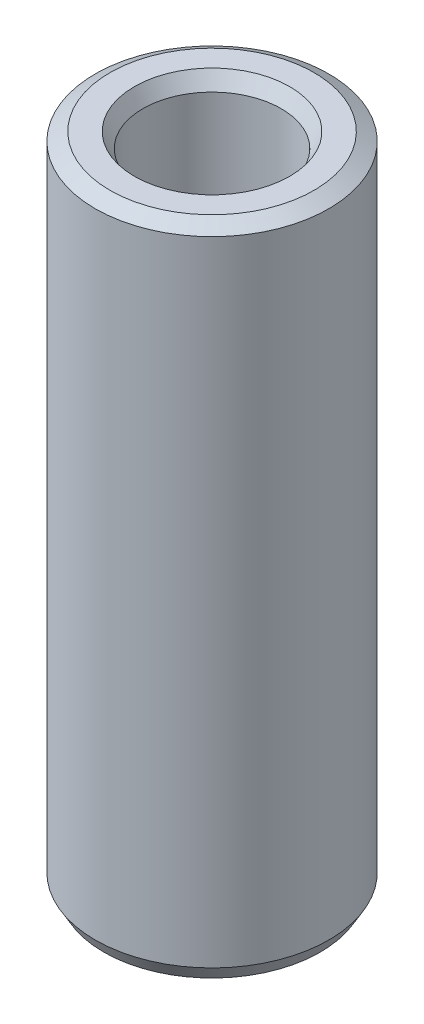
ISO-10303-21;
HEADER;
FILE_DESCRIPTION(('STEP AP214'),'2;1');
FILE_NAME('part.step','',(''),(''),'','','');
FILE_SCHEMA(('AUTOMOTIVE_DESIGN { 1 0 10303 214 1 1 1 1 }'));
ENDSEC;
DATA;
#1=APPLICATION_CONTEXT('core data for automotive mechanical design processes');
#2=APPLICATION_PROTOCOL_DEFINITION('international standard','automotive_design',2000,#1);
#3=PRODUCT_CONTEXT('',#1,'mechanical');
#4=PRODUCT('Part','Part','',(#3));
#5=PRODUCT_RELATED_PRODUCT_CATEGORY('part','',(#4));
#6=PRODUCT_DEFINITION_FORMATION('','',#4);
#7=PRODUCT_DEFINITION_CONTEXT('part definition',#1,'design');
#8=PRODUCT_DEFINITION('design','',#6,#7);
#9=PRODUCT_DEFINITION_SHAPE('','',#8);
#10=(LENGTH_UNIT() NAMED_UNIT(*) SI_UNIT(.MILLI.,.METRE.));
#11=(NAMED_UNIT(*) PLANE_ANGLE_UNIT() SI_UNIT($,.RADIAN.));
#12=(NAMED_UNIT(*) SI_UNIT($,.STERADIAN.) SOLID_ANGLE_UNIT());
#13=UNCERTAINTY_MEASURE_WITH_UNIT(LENGTH_MEASURE(1.E-05),#10,'distance_accuracy_value','');
#14=(GEOMETRIC_REPRESENTATION_CONTEXT(3) GLOBAL_UNCERTAINTY_ASSIGNED_CONTEXT((#13)) GLOBAL_UNIT_ASSIGNED_CONTEXT((#10,
#11,#12)) REPRESENTATION_CONTEXT('',''));
#15=CARTESIAN_POINT('',(0.,0.,0.));
#16=DIRECTION('',(0.,0.,1.));
#17=DIRECTION('',(1.,0.,0.));
#18=AXIS2_PLACEMENT_3D('',#15,#16,#17);
#19=CARTESIAN_POINT('',(0.,210.799337200619,0.));
#20=DIRECTION('',(0.,-1.,0.));
#21=DIRECTION('',(0.,0.,-1.));
#22=AXIS2_PLACEMENT_3D('',#19,#20,#21);
#23=CYLINDRICAL_SURFACE('',#22,37.5);
#24=CARTESIAN_POINT('',(0.,4.74482069295848,0.));
#25=DIRECTION('',(0.,1.,0.));
#26=DIRECTION('',(0.,0.,1.));
#27=AXIS2_PLACEMENT_3D('',#24,#25,#26);
#28=CIRCLE('',#27,37.5);
#29=CARTESIAN_POINT('',(0.,4.74482069295848,37.5));
#30=VERTEX_POINT('',#29);
#31=EDGE_CURVE('E10',#30,#30,#28,.T.);
#32=ORIENTED_EDGE('',*,*,#31,.T.);
#33=EDGE_LOOP('',(#32));
#34=FACE_BOUND('',#33,.T.);
#35=CARTESIAN_POINT('',(0.,208.059913696283,0.));
#36=DIRECTION('',(0.,1.,0.));
#37=DIRECTION('',(0.,0.,1.));
#38=AXIS2_PLACEMENT_3D('',#35,#36,#37);
#39=CIRCLE('',#38,37.5);
#40=CARTESIAN_POINT('',(0.,208.059913696283,37.5));
#41=VERTEX_POINT('',#40);
#42=EDGE_CURVE('E50',#41,#41,#39,.F.);
#43=ORIENTED_EDGE('',*,*,#42,.T.);
#44=EDGE_LOOP('',(#43));
#45=FACE_BOUND('',#44,.T.);
#46=ADVANCED_FACE('F39',(#34,#45),#23,.T.);
#47=CARTESIAN_POINT('',(0.,210.799337200619,0.));
#48=DIRECTION('',(0.,1.,0.));
#49=DIRECTION('',(0.,0.,1.));
#50=AXIS2_PLACEMENT_3D('',#47,#48,#49);
#51=PLANE('',#50);
#52=CARTESIAN_POINT('',(0.,210.799337200619,0.));
#53=DIRECTION('',(0.,1.,0.));
#54=DIRECTION('',(0.,0.,1.));
#55=AXIS2_PLACEMENT_3D('',#52,#53,#54);
#56=CIRCLE('',#55,24.9423415267909);
#57=CARTESIAN_POINT('',(0.,210.799337200619,24.9423415267909));
#58=VERTEX_POINT('',#57);
#59=EDGE_CURVE('E58',#58,#58,#56,.F.);
#60=ORIENTED_EDGE('',*,*,#59,.T.);
#61=EDGE_LOOP('',(#60));
#62=FACE_BOUND('',#61,.T.);
#63=CARTESIAN_POINT('',(0.,210.799337200619,0.));
#64=DIRECTION('',(0.,1.,0.));
#65=DIRECTION('',(0.,0.,1.));
#66=AXIS2_PLACEMENT_3D('',#63,#64,#65);
#67=CIRCLE('',#66,32.7551793070414);
#68=CARTESIAN_POINT('',(0.,210.799337200619,32.7551793070414));
#69=VERTEX_POINT('',#68);
#70=EDGE_CURVE('E61',#69,#69,#67,.T.);
#71=ORIENTED_EDGE('',*,*,#70,.T.);
#72=EDGE_LOOP('',(#71));
#73=FACE_BOUND('',#72,.T.);
#74=ADVANCED_FACE('F88',(#62,#73),#51,.T.);
#75=CARTESIAN_POINT('',(0.,0.,0.));
#76=DIRECTION('',(0.,1.,0.));
#77=DIRECTION('',(0.,0.,1.));
#78=AXIS2_PLACEMENT_3D('',#75,#76,#77);
#79=PLANE('',#78);
#80=CARTESIAN_POINT('',(0.,0.,0.));
#81=DIRECTION('',(0.,1.,0.));
#82=DIRECTION('',(0.,0.,1.));
#83=AXIS2_PLACEMENT_3D('',#80,#81,#82);
#84=CIRCLE('',#83,26.9477387154134);
#85=CARTESIAN_POINT('',(0.,0.,26.9477387154134));
#86=VERTEX_POINT('',#85);
#87=EDGE_CURVE('E51',#86,#86,#84,.T.);
#88=ORIENTED_EDGE('',*,*,#87,.T.);
#89=EDGE_LOOP('',(#88));
#90=FACE_BOUND('',#89,.T.);
#91=CARTESIAN_POINT('',(0.,0.,0.));
#92=DIRECTION('',(0.,1.,0.));
#93=DIRECTION('',(0.,0.,1.));
#94=AXIS2_PLACEMENT_3D('',#91,#92,#93);
#95=CIRCLE('',#94,34.7605764956639);
#96=CARTESIAN_POINT('',(0.,0.,34.7605764956639));
#97=VERTEX_POINT('',#96);
#98=EDGE_CURVE('E54',#97,#97,#95,.F.);
#99=ORIENTED_EDGE('',*,*,#98,.T.);
#100=EDGE_LOOP('',(#99));
#101=FACE_BOUND('',#100,.T.);
#102=ADVANCED_FACE('F83',(#90,#101),#79,.F.);
#103=CARTESIAN_POINT('',(0.,210.799337200619,0.));
#104=DIRECTION('',(0.,-1.,0.));
#105=DIRECTION('',(0.,0.,-1.));
#106=AXIS2_PLACEMENT_3D('',#103,#104,#105);
#107=CYLINDRICAL_SURFACE('',#106,22.2029180224547);
#108=CARTESIAN_POINT('',(0.,206.05451650766,0.));
#109=DIRECTION('',(0.,1.,0.));
#110=DIRECTION('',(0.,0.,1.));
#111=AXIS2_PLACEMENT_3D('',#108,#109,#110);
#112=CIRCLE('',#111,22.2029180224547);
#113=CARTESIAN_POINT('',(0.,206.05451650766,22.2029180224547));
#114=VERTEX_POINT('',#113);
#115=EDGE_CURVE('E67',#114,#114,#112,.T.);
#116=ORIENTED_EDGE('',*,*,#115,.T.);
#117=EDGE_LOOP('',(#116));
#118=FACE_BOUND('',#117,.T.);
#119=CARTESIAN_POINT('',(0.,2.7394235043362,0.));
#120=DIRECTION('',(0.,1.,0.));
#121=DIRECTION('',(0.,0.,1.));
#122=AXIS2_PLACEMENT_3D('',#119,#120,#121);
#123=CIRCLE('',#122,22.2029180224547);
#124=CARTESIAN_POINT('',(0.,2.7394235043362,22.2029180224547));
#125=VERTEX_POINT('',#124);
#126=EDGE_CURVE('E69',#125,#125,#123,.F.);
#127=ORIENTED_EDGE('',*,*,#126,.T.);
#128=EDGE_LOOP('',(#127));
#129=FACE_BOUND('',#128,.T.);
#130=ADVANCED_FACE('F71',(#118,#129),#107,.F.);
#131=CARTESIAN_POINT('',(0.,206.05451650766,0.));
#132=DIRECTION('',(0.,1.,0.));
#133=DIRECTION('',(0.,0.,1.));
#134=AXIS2_PLACEMENT_3D('',#131,#132,#133);
#135=CONICAL_SURFACE('',#134,22.2029180224547,0.523598775598297);
#136=ORIENTED_EDGE('',*,*,#59,.F.);
#137=EDGE_LOOP('',(#136));
#138=FACE_BOUND('',#137,.T.);
#139=ORIENTED_EDGE('',*,*,#115,.F.);
#140=EDGE_LOOP('',(#139));
#141=FACE_BOUND('',#140,.T.);
#142=ADVANCED_FACE('F77',(#138,#141),#135,.F.);
#143=CARTESIAN_POINT('',(0.,0.,0.));
#144=DIRECTION('',(0.,-1.,0.));
#145=DIRECTION('',(0.,0.,-1.));
#146=AXIS2_PLACEMENT_3D('',#143,#144,#145);
#147=CONICAL_SURFACE('',#146,26.9477387154134,1.04719755119659);
#148=ORIENTED_EDGE('',*,*,#126,.F.);
#149=EDGE_LOOP('',(#148));
#150=FACE_BOUND('',#149,.T.);
#151=ORIENTED_EDGE('',*,*,#87,.F.);
#152=EDGE_LOOP('',(#151));
#153=FACE_BOUND('',#152,.T.);
#154=ADVANCED_FACE('F73',(#150,#153),#147,.F.);
#155=CARTESIAN_POINT('',(0.,4.74482069295848,0.));
#156=DIRECTION('',(0.,1.,0.));
#157=DIRECTION('',(0.,0.,1.));
#158=AXIS2_PLACEMENT_3D('',#155,#156,#157);
#159=CONICAL_SURFACE('',#158,37.5,0.523598775598302);
#160=CARTESIAN_POINT('',(0.,0.,34.7605764956639));
#161=CARTESIAN_POINT('',(0.,0.0494252155516499,34.7891121571674));
#162=CARTESIAN_POINT('',(0.,0.0988504311033008,34.8176478186709));
#163=CARTESIAN_POINT('',(0.,0.197700862206602,34.8747191416779));
#164=CARTESIAN_POINT('',(0.,0.247126077758253,34.9032548031814));
#165=CARTESIAN_POINT('',(0.,0.345976508861555,34.9603261261884));
#166=CARTESIAN_POINT('',(0.,0.395401724413206,34.9888617876919));
#167=CARTESIAN_POINT('',(0.,0.494252155516507,35.0459331106989));
#168=CARTESIAN_POINT('',(0.,0.543677371068158,35.0744687722024));
#169=CARTESIAN_POINT('',(0.,0.64252780217146,35.1315400952094));
#170=CARTESIAN_POINT('',(0.,0.691953017723111,35.1600757567129));
#171=CARTESIAN_POINT('',(0.,0.790803448826412,35.2171470797199));
#172=CARTESIAN_POINT('',(0.,0.840228664378063,35.2456827412234));
#173=CARTESIAN_POINT('',(0.,0.939079095481364,35.3027540642304));
#174=CARTESIAN_POINT('',(0.,0.988504311033015,35.3312897257339));
#175=CARTESIAN_POINT('',(0.,1.08735474213632,35.3883610487409));
#176=CARTESIAN_POINT('',(0.,1.13677995768797,35.4168967102444));
#177=CARTESIAN_POINT('',(0.,1.23563038879127,35.4739680332514));
#178=CARTESIAN_POINT('',(0.,1.28505560434292,35.5025036947549));
#179=CARTESIAN_POINT('',(0.,1.38390603544622,35.5595750177619));
#180=CARTESIAN_POINT('',(0.,1.43333125099787,35.5881106792654));
#181=CARTESIAN_POINT('',(0.,1.53218168210117,35.6451820022724));
#182=CARTESIAN_POINT('',(0.,1.58160689765282,35.6737176637759));
#183=CARTESIAN_POINT('',(0.,1.68045732875613,35.7307889867829));
#184=CARTESIAN_POINT('',(0.,1.72988254430778,35.7593246482864));
#185=CARTESIAN_POINT('',(0.,1.82873297541108,35.8163959712934));
#186=CARTESIAN_POINT('',(0.,1.87815819096273,35.8449316327969));
#187=CARTESIAN_POINT('',(0.,1.97700862206603,35.9020029558039));
#188=CARTESIAN_POINT('',(0.,2.02643383761768,35.9305386173074));
#189=CARTESIAN_POINT('',(0.,2.12528426872098,35.9876099403144));
#190=CARTESIAN_POINT('',(0.,2.17470948427264,36.0161456018179));
#191=CARTESIAN_POINT('',(0.,2.27355991537594,36.0732169248249));
#192=CARTESIAN_POINT('',(0.,2.32298513092759,36.1017525863285));
#193=CARTESIAN_POINT('',(0.,2.42183556203089,36.1588239093355));
#194=CARTESIAN_POINT('',(0.,2.47126077758254,36.187359570839));
#195=CARTESIAN_POINT('',(0.,2.57011120868584,36.244430893846));
#196=CARTESIAN_POINT('',(0.,2.61953642423749,36.2729665553495));
#197=CARTESIAN_POINT('',(0.,2.71838685534079,36.3300378783565));
#198=CARTESIAN_POINT('',(0.,2.76781207089245,36.35857353986));
#199=CARTESIAN_POINT('',(0.,2.86666250199575,36.415644862867));
#200=CARTESIAN_POINT('',(0.,2.9160877175474,36.4441805243705));
#201=CARTESIAN_POINT('',(0.,3.0149381486507,36.5012518473775));
#202=CARTESIAN_POINT('',(0.,3.06436336420235,36.529787508881));
#203=CARTESIAN_POINT('',(0.,3.16321379530565,36.586858831888));
#204=CARTESIAN_POINT('',(0.,3.2126390108573,36.6153944933915));
#205=CARTESIAN_POINT('',(0.,3.3114894419606,36.6724658163985));
#206=CARTESIAN_POINT('',(0.,3.36091465751226,36.701001477902));
#207=CARTESIAN_POINT('',(0.,3.45976508861556,36.758072800909));
#208=CARTESIAN_POINT('',(0.,3.50919030416721,36.7866084624125));
#209=CARTESIAN_POINT('',(0.,3.60804073527051,36.8436797854195));
#210=CARTESIAN_POINT('',(0.,3.65746595082216,36.872215446923));
#211=CARTESIAN_POINT('',(0.,3.75631638192546,36.92928676993));
#212=CARTESIAN_POINT('',(0.,3.80574159747711,36.9578224314335));
#213=CARTESIAN_POINT('',(0.,3.90459202858041,37.0148937544405));
#214=CARTESIAN_POINT('',(0.,3.95401724413207,37.043429415944));
#215=CARTESIAN_POINT('',(0.,4.05286767523537,37.100500738951));
#216=CARTESIAN_POINT('',(0.,4.10229289078702,37.1290364004545));
#217=CARTESIAN_POINT('',(0.,4.20114332189032,37.1861077234615));
#218=CARTESIAN_POINT('',(0.,4.25056853744197,37.214643384965));
#219=CARTESIAN_POINT('',(0.,4.34941896854527,37.271714707972));
#220=CARTESIAN_POINT('',(0.,4.39884418409692,37.3002503694755));
#221=CARTESIAN_POINT('',(0.,4.49769461520022,37.3573216924825));
#222=CARTESIAN_POINT('',(0.,4.54711983075187,37.385857353986));
#223=CARTESIAN_POINT('',(0.,4.64597026185518,37.442928676993));
#224=CARTESIAN_POINT('',(0.,4.69539547740683,37.4714643384965));
#225=CARTESIAN_POINT('',(0.,4.74482069295848,37.5));
#226=B_SPLINE_CURVE_WITH_KNOTS('',3,(#160,#161,#162,#163,#164,#165,#166,#167,#168,#169,#170,
#171,#172,#173,#174,#175,#176,#177,#178,#179,#180,#181,#182,#183,#184,#185,#186,#187,#188,#189,
#190,#191,#192,#193,#194,#195,#196,#197,#198,#199,#200,#201,#202,#203,#204,#205,#206,#207,#208,
#209,#210,#211,#212,#213,#214,#215,#216,#217,#218,#219,#220,#221,#222,#223,#224,#225),
.UNSPECIFIED.,.F.,.F.,(4,2,2,2,2,2,2,2,2,2,2,2,2,2,2,2,2,2,2,2,2,2,2,2,2,2,2,2,2,2,2,2,4),(0.,
0.171213969021005,0.342427938042011,0.513641907063016,0.684855876084022,0.856069845105027,
1.02728381412603,1.19849778314704,1.36971175216804,1.54092572118905,1.71213969021005,
1.88335365923106,2.05456762825207,2.22578159727307,2.39699556629408,2.56820953531508,
2.73942350433609,2.91063747335709,3.0818514423781,3.2530654113991,3.42427938042011,
3.59549334944112,3.76670731846212,3.93792128748313,4.10913525650413,4.28034922552514,
4.45156319454615,4.62277716356715,4.79399113258816,4.96520510160916,5.13641907063017,
5.30763303965118,5.47884700867218),.UNSPECIFIED.);
#227=EDGE_CURVE('BSEAM76',#97,#30,#226,.T.);
#228=ORIENTED_EDGE('',*,*,#98,.F.);
#229=ORIENTED_EDGE('',*,*,#31,.F.);
#230=ORIENTED_EDGE('',*,*,#227,.T.);
#231=ORIENTED_EDGE('',*,*,#227,.F.);
#232=EDGE_LOOP('',(#228,#230,#229,#231));
#233=FACE_BOUND('',#232,.T.);
#234=ADVANCED_FACE('F76',(#233),#159,.T.);
#235=CARTESIAN_POINT('',(0.,210.799337200619,0.));
#236=DIRECTION('',(0.,-1.,0.));
#237=DIRECTION('',(0.,0.,-1.));
#238=AXIS2_PLACEMENT_3D('',#235,#236,#237);
#239=CONICAL_SURFACE('',#238,32.7551793070414,1.04719755119659);
#240=ORIENTED_EDGE('',*,*,#42,.F.);
#241=EDGE_LOOP('',(#240));
#242=FACE_BOUND('',#241,.T.);
#243=ORIENTED_EDGE('',*,*,#70,.F.);
#244=EDGE_LOOP('',(#243));
#245=FACE_BOUND('',#244,.T.);
#246=ADVANCED_FACE('F45',(#242,#245),#239,.T.);
#247=CLOSED_SHELL('',(#46,#74,#102,#130,#142,#154,#234,#246));
#248=MANIFOLD_SOLID_BREP('B2',#247);
#249=ADVANCED_BREP_SHAPE_REPRESENTATION('',(#18,#248),#14);
#250=SHAPE_DEFINITION_REPRESENTATION(#9,#249);
ENDSEC;
END-ISO-10303-21;
